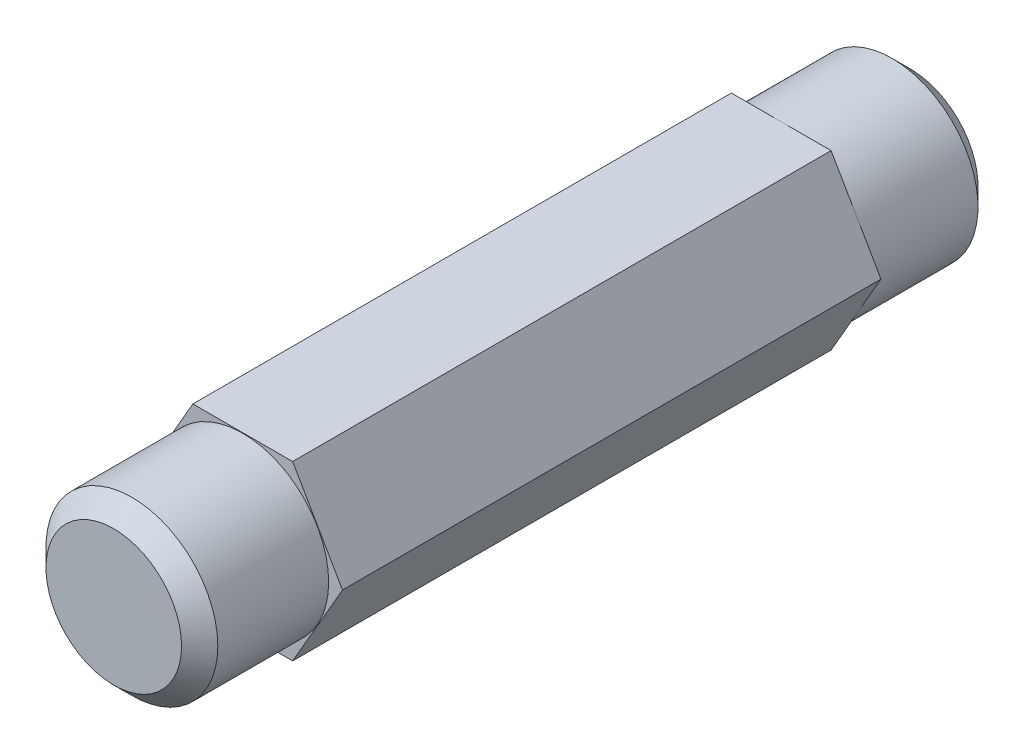
ISO-10303-21;
HEADER;
FILE_DESCRIPTION(('STEP AP214'),'2;1');
FILE_NAME('part.step','',(''),(''),'','','');
FILE_SCHEMA(('AUTOMOTIVE_DESIGN { 1 0 10303 214 1 1 1 1 }'));
ENDSEC;
DATA;
#1=APPLICATION_CONTEXT('core data for automotive mechanical design processes');
#2=APPLICATION_PROTOCOL_DEFINITION('international standard','automotive_design',2000,#1);
#3=PRODUCT_CONTEXT('',#1,'mechanical');
#4=PRODUCT('Part','Part','',(#3));
#5=PRODUCT_RELATED_PRODUCT_CATEGORY('part','',(#4));
#6=PRODUCT_DEFINITION_FORMATION('','',#4);
#7=PRODUCT_DEFINITION_CONTEXT('part definition',#1,'design');
#8=PRODUCT_DEFINITION('design','',#6,#7);
#9=PRODUCT_DEFINITION_SHAPE('','',#8);
#10=(LENGTH_UNIT() NAMED_UNIT(*) SI_UNIT(.MILLI.,.METRE.));
#11=(NAMED_UNIT(*) PLANE_ANGLE_UNIT() SI_UNIT($,.RADIAN.));
#12=(NAMED_UNIT(*) SI_UNIT($,.STERADIAN.) SOLID_ANGLE_UNIT());
#13=UNCERTAINTY_MEASURE_WITH_UNIT(LENGTH_MEASURE(1.E-05),#10,'distance_accuracy_value','');
#14=(GEOMETRIC_REPRESENTATION_CONTEXT(3) GLOBAL_UNCERTAINTY_ASSIGNED_CONTEXT((#13)) GLOBAL_UNIT_ASSIGNED_CONTEXT((#10,
#11,#12)) REPRESENTATION_CONTEXT('',''));
#15=CARTESIAN_POINT('',(0.,0.,0.));
#16=DIRECTION('',(0.,0.,1.));
#17=DIRECTION('',(1.,0.,0.));
#18=AXIS2_PLACEMENT_3D('',#15,#16,#17);
#19=CARTESIAN_POINT('',(0.,0.,-21.9583));
#20=DIRECTION('',(0.,0.,-1.));
#21=DIRECTION('',(1.,0.,0.));
#22=AXIS2_PLACEMENT_3D('',#19,#20,#21);
#23=PLANE('',#22);
#24=CARTESIAN_POINT('',(0.,0.,-21.9582999999943));
#25=DIRECTION('',(0.,0.,-1.));
#26=DIRECTION('',(-1.,0.,0.));
#27=AXIS2_PLACEMENT_3D('',#24,#25,#26);
#28=CIRCLE('',#27,3.73710000002347);
#29=CARTESIAN_POINT('',(-3.73710000002347,0.,-21.9582999999943));
#30=VERTEX_POINT('',#29);
#31=EDGE_CURVE('E40',#30,#30,#28,.T.);
#32=ORIENTED_EDGE('',*,*,#31,.T.);
#33=EDGE_LOOP('',(#32));
#34=FACE_BOUND('',#33,.T.);
#35=ADVANCED_FACE('F37',(#34),#23,.T.);
#36=CARTESIAN_POINT('',(0.,0.,21.9583));
#37=DIRECTION('',(0.,0.,1.));
#38=DIRECTION('',(-1.,0.,0.));
#39=AXIS2_PLACEMENT_3D('',#36,#37,#38);
#40=PLANE('',#39);
#41=CARTESIAN_POINT('',(0.,0.,21.9583000000512));
#42=DIRECTION('',(0.,0.,1.));
#43=DIRECTION('',(1.,0.,0.));
#44=AXIS2_PLACEMENT_3D('',#41,#42,#43);
#45=CIRCLE('',#44,3.73709999996663);
#46=CARTESIAN_POINT('',(3.73709999996663,0.,21.9583000000512));
#47=VERTEX_POINT('',#46);
#48=EDGE_CURVE('E121',#47,#47,#45,.T.);
#49=ORIENTED_EDGE('',*,*,#48,.T.);
#50=EDGE_LOOP('',(#49));
#51=FACE_BOUND('',#50,.T.);
#52=ADVANCED_FACE('F140',(#51),#40,.T.);
#53=CARTESIAN_POINT('',(0.,0.,-20.9582999999043));
#54=DIRECTION('',(0.,0.,1.));
#55=DIRECTION('',(-1.,0.,0.));
#56=AXIS2_PLACEMENT_3D('',#53,#54,#55);
#57=CONICAL_SURFACE('',#56,4.73710000011351,0.785398163397448);
#58=CARTESIAN_POINT('',(0.,0.,-20.9583));
#59=DIRECTION('',(0.,0.,-1.));
#60=DIRECTION('',(-1.,0.,0.));
#61=AXIS2_PLACEMENT_3D('',#58,#59,#60);
#62=CIRCLE('',#61,4.7371);
#63=CARTESIAN_POINT('',(-4.7371,0.,-20.9583));
#64=VERTEX_POINT('',#63);
#65=EDGE_CURVE('E118',#64,#64,#62,.T.);
#66=ORIENTED_EDGE('',*,*,#65,.T.);
#67=EDGE_LOOP('',(#66));
#68=FACE_BOUND('',#67,.T.);
#69=ORIENTED_EDGE('',*,*,#31,.F.);
#70=EDGE_LOOP('',(#69));
#71=FACE_BOUND('',#70,.T.);
#72=ADVANCED_FACE('F137',(#68,#71),#57,.T.);
#73=CARTESIAN_POINT('',(0.,0.,20.958300000018));
#74=DIRECTION('',(0.,0.,-1.));
#75=DIRECTION('',(1.,0.,0.));
#76=AXIS2_PLACEMENT_3D('',#73,#74,#75);
#77=CONICAL_SURFACE('',#76,4.73709999994298,0.785398163369027);
#78=CARTESIAN_POINT('',(0.,0.,20.9583));
#79=DIRECTION('',(0.,0.,1.));
#80=DIRECTION('',(1.,0.,0.));
#81=AXIS2_PLACEMENT_3D('',#78,#79,#80);
#82=CIRCLE('',#81,4.7371);
#83=CARTESIAN_POINT('',(4.7371,0.,20.9583));
#84=VERTEX_POINT('',#83);
#85=EDGE_CURVE('E113',#84,#84,#82,.T.);
#86=ORIENTED_EDGE('',*,*,#85,.T.);
#87=EDGE_LOOP('',(#86));
#88=FACE_BOUND('',#87,.T.);
#89=ORIENTED_EDGE('',*,*,#48,.F.);
#90=EDGE_LOOP('',(#89));
#91=FACE_BOUND('',#90,.T.);
#92=ADVANCED_FACE('F139',(#88,#91),#77,.T.);
#93=CARTESIAN_POINT('',(0.,0.,-21.9583));
#94=DIRECTION('',(0.,0.,1.));
#95=DIRECTION('',(-1.,0.,0.));
#96=AXIS2_PLACEMENT_3D('',#93,#94,#95);
#97=CYLINDRICAL_SURFACE('',#96,4.7371);
#98=CARTESIAN_POINT('',(0.,0.,-14.8463));
#99=DIRECTION('',(0.,0.,-1.));
#100=DIRECTION('',(-1.,0.,0.));
#101=AXIS2_PLACEMENT_3D('',#98,#99,#100);
#102=CIRCLE('',#101,4.7371);
#103=CARTESIAN_POINT('',(-4.7371,0.,-14.8463));
#104=VERTEX_POINT('',#103);
#105=EDGE_CURVE('E126',#104,#104,#102,.T.);
#106=ORIENTED_EDGE('',*,*,#105,.T.);
#107=EDGE_LOOP('',(#106));
#108=FACE_BOUND('',#107,.T.);
#109=ORIENTED_EDGE('',*,*,#65,.F.);
#110=EDGE_LOOP('',(#109));
#111=FACE_BOUND('',#110,.T.);
#112=ADVANCED_FACE('F147',(#108,#111),#97,.T.);
#113=CARTESIAN_POINT('',(0.,0.,21.9583));
#114=DIRECTION('',(0.,0.,-1.));
#115=DIRECTION('',(1.,0.,0.));
#116=AXIS2_PLACEMENT_3D('',#113,#114,#115);
#117=CYLINDRICAL_SURFACE('',#116,4.7371);
#118=CARTESIAN_POINT('',(0.,0.,14.8463));
#119=DIRECTION('',(0.,0.,1.));
#120=DIRECTION('',(1.,0.,0.));
#121=AXIS2_PLACEMENT_3D('',#118,#119,#120);
#122=CIRCLE('',#121,4.7371);
#123=CARTESIAN_POINT('',(4.7371,0.,14.8463));
#124=VERTEX_POINT('',#123);
#125=EDGE_CURVE('E122',#124,#124,#122,.F.);
#126=ORIENTED_EDGE('',*,*,#125,.F.);
#127=EDGE_LOOP('',(#126));
#128=FACE_BOUND('',#127,.T.);
#129=ORIENTED_EDGE('',*,*,#85,.F.);
#130=EDGE_LOOP('',(#129));
#131=FACE_BOUND('',#130,.T.);
#132=ADVANCED_FACE('F176',(#128,#131),#117,.T.);
#133=CARTESIAN_POINT('',(5.49926131403118,0.,-14.8463));
#134=DIRECTION('',(-0.866025403784439,-0.5,0.));
#135=DIRECTION('',(0.5,-0.866025403784439,0.));
#136=AXIS2_PLACEMENT_3D('',#133,#134,#135);
#137=PLANE('',#136);
#138=DIRECTION('',(0.,0.,1.));
#139=VECTOR('',#138,1.);
#140=CARTESIAN_POINT('',(2.74963065701559,4.7625,-14.8463));
#141=LINE('',#140,#139);
#142=CARTESIAN_POINT('',(2.74963065701559,4.7625,14.8463));
#143=VERTEX_POINT('',#142);
#144=CARTESIAN_POINT('',(2.74963065701559,4.7625,-14.8463));
#145=VERTEX_POINT('',#144);
#146=EDGE_CURVE('E97',#143,#145,#141,.F.);
#147=ORIENTED_EDGE('',*,*,#146,.F.);
#148=DIRECTION('',(-0.5,0.866025403784439,0.));
#149=VECTOR('',#148,1.);
#150=CARTESIAN_POINT('',(5.49926131403118,0.,14.8463));
#151=LINE('',#150,#149);
#152=CARTESIAN_POINT('',(5.49926131403118,0.,14.8463));
#153=VERTEX_POINT('',#152);
#154=EDGE_CURVE('E110',#153,#143,#151,.T.);
#155=ORIENTED_EDGE('',*,*,#154,.F.);
#156=DIRECTION('',(0.,0.,-1.));
#157=VECTOR('',#156,1.);
#158=CARTESIAN_POINT('',(5.49926131403118,0.,-14.8463));
#159=LINE('',#158,#157);
#160=CARTESIAN_POINT('',(5.49926131403118,0.,-14.8463));
#161=VERTEX_POINT('',#160);
#162=EDGE_CURVE('E92',#161,#153,#159,.F.);
#163=ORIENTED_EDGE('',*,*,#162,.F.);
#164=DIRECTION('',(-0.5,0.866025403784439,0.));
#165=VECTOR('',#164,1.);
#166=CARTESIAN_POINT('',(5.49926131403118,0.,-14.8463));
#167=LINE('',#166,#165);
#168=EDGE_CURVE('E96',#161,#145,#167,.T.);
#169=ORIENTED_EDGE('',*,*,#168,.T.);
#170=EDGE_LOOP('',(#147,#155,#163,#169));
#171=FACE_BOUND('',#170,.T.);
#172=ADVANCED_FACE('F108',(#171),#137,.F.);
#173=CARTESIAN_POINT('',(-2.74963065701559,-4.7625,-14.8463));
#174=DIRECTION('',(0.,1.,0.));
#175=DIRECTION('',(0.,0.,-1.));
#176=AXIS2_PLACEMENT_3D('',#173,#174,#175);
#177=PLANE('',#176);
#178=DIRECTION('',(0.,0.,-1.));
#179=VECTOR('',#178,1.);
#180=CARTESIAN_POINT('',(2.74963065701559,-4.7625,-14.8463));
#181=LINE('',#180,#179);
#182=CARTESIAN_POINT('',(2.74963065701559,-4.7625,14.8463));
#183=VERTEX_POINT('',#182);
#184=CARTESIAN_POINT('',(2.74963065701559,-4.7625,-14.8463));
#185=VERTEX_POINT('',#184);
#186=EDGE_CURVE('E95',#183,#185,#181,.T.);
#187=ORIENTED_EDGE('',*,*,#186,.F.);
#188=DIRECTION('',(1.,0.,0.));
#189=VECTOR('',#188,1.);
#190=CARTESIAN_POINT('',(5.49926131403118,-4.7625,14.8463));
#191=LINE('',#190,#189);
#192=CARTESIAN_POINT('',(-2.74963065701559,-4.7625,14.8463));
#193=VERTEX_POINT('',#192);
#194=EDGE_CURVE('E274',#193,#183,#191,.T.);
#195=ORIENTED_EDGE('',*,*,#194,.F.);
#196=DIRECTION('',(0.,0.,-1.));
#197=VECTOR('',#196,1.);
#198=CARTESIAN_POINT('',(-2.74963065701559,-4.7625,-14.8463));
#199=LINE('',#198,#197);
#200=CARTESIAN_POINT('',(-2.74963065701559,-4.7625,-14.8463));
#201=VERTEX_POINT('',#200);
#202=EDGE_CURVE('E125',#201,#193,#199,.F.);
#203=ORIENTED_EDGE('',*,*,#202,.F.);
#204=DIRECTION('',(1.,0.,0.));
#205=VECTOR('',#204,1.);
#206=CARTESIAN_POINT('',(5.49926131403118,-4.7625,-14.8463));
#207=LINE('',#206,#205);
#208=EDGE_CURVE('E129',#201,#185,#207,.T.);
#209=ORIENTED_EDGE('',*,*,#208,.T.);
#210=EDGE_LOOP('',(#187,#195,#203,#209));
#211=FACE_BOUND('',#210,.T.);
#212=ADVANCED_FACE('F195',(#211),#177,.F.);
#213=CARTESIAN_POINT('',(2.74963065701559,-4.7625,-14.8463));
#214=DIRECTION('',(-0.866025403784439,0.5,0.));
#215=DIRECTION('',(-0.5,-0.866025403784439,0.));
#216=AXIS2_PLACEMENT_3D('',#213,#214,#215);
#217=PLANE('',#216);
#218=ORIENTED_EDGE('',*,*,#162,.T.);
#219=DIRECTION('',(0.5,0.866025403784439,0.));
#220=VECTOR('',#219,1.);
#221=CARTESIAN_POINT('',(2.74963065701559,-4.7625,14.8463));
#222=LINE('',#221,#220);
#223=EDGE_CURVE('E277',#183,#153,#222,.T.);
#224=ORIENTED_EDGE('',*,*,#223,.F.);
#225=ORIENTED_EDGE('',*,*,#186,.T.);
#226=DIRECTION('',(0.5,0.866025403784439,0.));
#227=VECTOR('',#226,1.);
#228=CARTESIAN_POINT('',(2.74963065701559,-4.7625,-14.8463));
#229=LINE('',#228,#227);
#230=EDGE_CURVE('E85',#185,#161,#229,.T.);
#231=ORIENTED_EDGE('',*,*,#230,.T.);
#232=EDGE_LOOP('',(#218,#224,#225,#231));
#233=FACE_BOUND('',#232,.T.);
#234=ADVANCED_FACE('F90',(#233),#217,.F.);
#235=CARTESIAN_POINT('',(2.74963065701559,4.7625,-14.8463));
#236=DIRECTION('',(0.,-1.,0.));
#237=DIRECTION('',(0.,0.,1.));
#238=AXIS2_PLACEMENT_3D('',#235,#236,#237);
#239=PLANE('',#238);
#240=DIRECTION('',(0.,0.,-1.));
#241=VECTOR('',#240,1.);
#242=CARTESIAN_POINT('',(-2.74963065701559,4.7625,-14.8463));
#243=LINE('',#242,#241);
#244=CARTESIAN_POINT('',(-2.74963065701559,4.7625,14.8463));
#245=VERTEX_POINT('',#244);
#246=CARTESIAN_POINT('',(-2.74963065701559,4.7625,-14.8463));
#247=VERTEX_POINT('',#246);
#248=EDGE_CURVE('E287',#245,#247,#243,.T.);
#249=ORIENTED_EDGE('',*,*,#248,.F.);
#250=DIRECTION('',(1.,0.,0.));
#251=VECTOR('',#250,1.);
#252=CARTESIAN_POINT('',(5.49926131403118,4.7625,14.8463));
#253=LINE('',#252,#251);
#254=EDGE_CURVE('E275',#143,#245,#253,.F.);
#255=ORIENTED_EDGE('',*,*,#254,.F.);
#256=ORIENTED_EDGE('',*,*,#146,.T.);
#257=DIRECTION('',(1.,0.,0.));
#258=VECTOR('',#257,1.);
#259=CARTESIAN_POINT('',(5.49926131403118,4.7625,-14.8463));
#260=LINE('',#259,#258);
#261=EDGE_CURVE('E103',#145,#247,#260,.F.);
#262=ORIENTED_EDGE('',*,*,#261,.T.);
#263=EDGE_LOOP('',(#249,#255,#256,#262));
#264=FACE_BOUND('',#263,.T.);
#265=ADVANCED_FACE('F213',(#264),#239,.F.);
#266=CARTESIAN_POINT('',(5.49926131403118,0.,-14.8463));
#267=DIRECTION('',(0.,0.,-1.));
#268=DIRECTION('',(1.,0.,0.));
#269=AXIS2_PLACEMENT_3D('',#266,#267,#268);
#270=PLANE('',#269);
#271=ORIENTED_EDGE('',*,*,#105,.F.);
#272=EDGE_LOOP('',(#271));
#273=FACE_BOUND('',#272,.T.);
#274=DIRECTION('',(-0.5,0.866025403784439,0.));
#275=VECTOR('',#274,1.);
#276=CARTESIAN_POINT('',(-5.49926131403119,0.,-14.8463));
#277=LINE('',#276,#275);
#278=CARTESIAN_POINT('',(-5.49926131403119,0.,-14.8463));
#279=VERTEX_POINT('',#278);
#280=EDGE_CURVE('E128',#279,#201,#277,.F.);
#281=ORIENTED_EDGE('',*,*,#280,.F.);
#282=DIRECTION('',(0.5,0.866025403784439,0.));
#283=VECTOR('',#282,1.);
#284=CARTESIAN_POINT('',(-2.74963065701559,4.7625,-14.8463));
#285=LINE('',#284,#283);
#286=EDGE_CURVE('E267',#247,#279,#285,.F.);
#287=ORIENTED_EDGE('',*,*,#286,.F.);
#288=ORIENTED_EDGE('',*,*,#261,.F.);
#289=ORIENTED_EDGE('',*,*,#168,.F.);
#290=ORIENTED_EDGE('',*,*,#230,.F.);
#291=ORIENTED_EDGE('',*,*,#208,.F.);
#292=EDGE_LOOP('',(#281,#287,#288,#289,#290,#291));
#293=FACE_BOUND('',#292,.T.);
#294=ADVANCED_FACE('F101',(#273,#293),#270,.T.);
#295=CARTESIAN_POINT('',(-5.49926131403119,0.,-14.8463));
#296=DIRECTION('',(0.866025403784439,0.5,0.));
#297=DIRECTION('',(-0.5,0.866025403784439,0.));
#298=AXIS2_PLACEMENT_3D('',#295,#296,#297);
#299=PLANE('',#298);
#300=ORIENTED_EDGE('',*,*,#202,.T.);
#301=DIRECTION('',(0.5,-0.866025403784439,0.));
#302=VECTOR('',#301,1.);
#303=CARTESIAN_POINT('',(-5.49926131403119,0.,14.8463));
#304=LINE('',#303,#302);
#305=CARTESIAN_POINT('',(-5.49926131403119,0.,14.8463));
#306=VERTEX_POINT('',#305);
#307=EDGE_CURVE('E270',#306,#193,#304,.T.);
#308=ORIENTED_EDGE('',*,*,#307,.F.);
#309=DIRECTION('',(0.,0.,-1.));
#310=VECTOR('',#309,1.);
#311=CARTESIAN_POINT('',(-5.49926131403119,0.,-14.8463));
#312=LINE('',#311,#310);
#313=EDGE_CURVE('E46',#279,#306,#312,.F.);
#314=ORIENTED_EDGE('',*,*,#313,.F.);
#315=ORIENTED_EDGE('',*,*,#280,.T.);
#316=EDGE_LOOP('',(#300,#308,#314,#315));
#317=FACE_BOUND('',#316,.T.);
#318=ADVANCED_FACE('F231',(#317),#299,.F.);
#319=CARTESIAN_POINT('',(5.49926131403118,0.,14.8463));
#320=DIRECTION('',(0.,0.,-1.));
#321=DIRECTION('',(1.,0.,0.));
#322=AXIS2_PLACEMENT_3D('',#319,#320,#321);
#323=PLANE('',#322);
#324=ORIENTED_EDGE('',*,*,#194,.T.);
#325=ORIENTED_EDGE('',*,*,#223,.T.);
#326=ORIENTED_EDGE('',*,*,#154,.T.);
#327=ORIENTED_EDGE('',*,*,#254,.T.);
#328=DIRECTION('',(0.5,0.866025403784439,0.));
#329=VECTOR('',#328,1.);
#330=CARTESIAN_POINT('',(-2.74963065701559,4.7625,14.8463));
#331=LINE('',#330,#329);
#332=EDGE_CURVE('E11',#306,#245,#331,.T.);
#333=ORIENTED_EDGE('',*,*,#332,.F.);
#334=ORIENTED_EDGE('',*,*,#307,.T.);
#335=EDGE_LOOP('',(#324,#325,#326,#327,#333,#334));
#336=FACE_BOUND('',#335,.T.);
#337=ORIENTED_EDGE('',*,*,#125,.T.);
#338=EDGE_LOOP('',(#337));
#339=FACE_BOUND('',#338,.T.);
#340=ADVANCED_FACE('F241',(#336,#339),#323,.F.);
#341=CARTESIAN_POINT('',(-2.74963065701559,4.7625,-14.8463));
#342=DIRECTION('',(0.866025403784439,-0.5,0.));
#343=DIRECTION('',(0.5,0.866025403784439,0.));
#344=AXIS2_PLACEMENT_3D('',#341,#342,#343);
#345=PLANE('',#344);
#346=ORIENTED_EDGE('',*,*,#313,.T.);
#347=ORIENTED_EDGE('',*,*,#332,.T.);
#348=ORIENTED_EDGE('',*,*,#248,.T.);
#349=ORIENTED_EDGE('',*,*,#286,.T.);
#350=EDGE_LOOP('',(#346,#347,#348,#349));
#351=FACE_BOUND('',#350,.T.);
#352=ADVANCED_FACE('F251',(#351),#345,.F.);
#353=CLOSED_SHELL('',(#35,#52,#72,#92,#112,#132,#172,#212,#234,#265,#294,#318,#340,#352));
#354=MANIFOLD_SOLID_BREP('B2',#353);
#355=ADVANCED_BREP_SHAPE_REPRESENTATION('',(#18,#354),#14);
#356=SHAPE_DEFINITION_REPRESENTATION(#9,#355);
ENDSEC;
END-ISO-10303-21;
